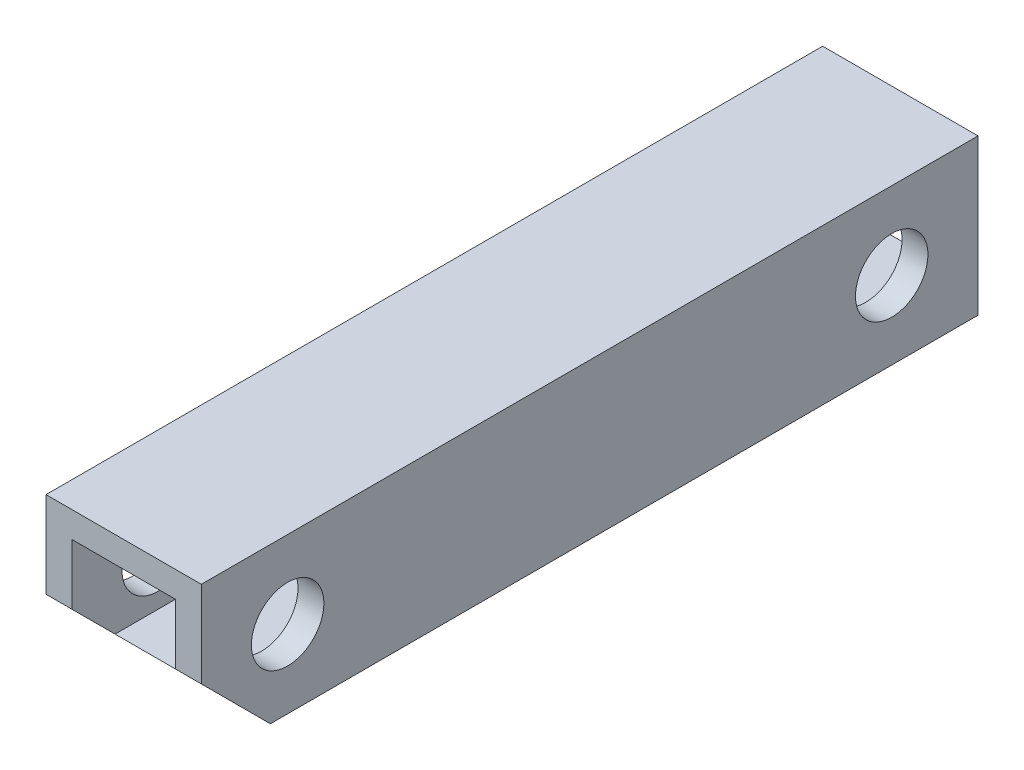
ISO-10303-21;
HEADER;
FILE_DESCRIPTION(('STEP AP214'),'2;1');
FILE_NAME('part.step','',(''),(''),'','','');
FILE_SCHEMA(('AUTOMOTIVE_DESIGN { 1 0 10303 214 1 1 1 1 }'));
ENDSEC;
DATA;
#1=APPLICATION_CONTEXT('core data for automotive mechanical design processes');
#2=APPLICATION_PROTOCOL_DEFINITION('international standard','automotive_design',2000,#1);
#3=PRODUCT_CONTEXT('',#1,'mechanical');
#4=PRODUCT('Part','Part','',(#3));
#5=PRODUCT_RELATED_PRODUCT_CATEGORY('part','',(#4));
#6=PRODUCT_DEFINITION_FORMATION('','',#4);
#7=PRODUCT_DEFINITION_CONTEXT('part definition',#1,'design');
#8=PRODUCT_DEFINITION('design','',#6,#7);
#9=PRODUCT_DEFINITION_SHAPE('','',#8);
#10=(LENGTH_UNIT() NAMED_UNIT(*) SI_UNIT(.MILLI.,.METRE.));
#11=(NAMED_UNIT(*) PLANE_ANGLE_UNIT() SI_UNIT($,.RADIAN.));
#12=(NAMED_UNIT(*) SI_UNIT($,.STERADIAN.) SOLID_ANGLE_UNIT());
#13=UNCERTAINTY_MEASURE_WITH_UNIT(LENGTH_MEASURE(1.E-05),#10,'distance_accuracy_value','');
#14=(GEOMETRIC_REPRESENTATION_CONTEXT(3) GLOBAL_UNCERTAINTY_ASSIGNED_CONTEXT((#13)) GLOBAL_UNIT_ASSIGNED_CONTEXT((#10,
#11,#12)) REPRESENTATION_CONTEXT('',''));
#15=CARTESIAN_POINT('',(0.,0.,0.));
#16=DIRECTION('',(0.,0.,1.));
#17=DIRECTION('',(1.,0.,0.));
#18=AXIS2_PLACEMENT_3D('',#15,#16,#17);
#19=CARTESIAN_POINT('',(0.,0.,45.));
#20=DIRECTION('',(0.,0.,1.));
#21=DIRECTION('',(1.,0.,0.));
#22=AXIS2_PLACEMENT_3D('',#19,#20,#21);
#23=PLANE('',#22);
#24=DIRECTION('',(1.,0.,0.));
#25=VECTOR('',#24,1.);
#26=CARTESIAN_POINT('',(-5.5,-0.500000000000002,45.));
#27=LINE('',#26,#25);
#28=CARTESIAN_POINT('',(3.,-0.500000000000001,45.));
#29=VERTEX_POINT('',#28);
#30=CARTESIAN_POINT('',(4.5,-0.5,45.));
#31=VERTEX_POINT('',#30);
#32=EDGE_CURVE('E118',#29,#31,#27,.T.);
#33=ORIENTED_EDGE('',*,*,#32,.T.);
#34=DIRECTION('',(0.,1.,0.));
#35=VECTOR('',#34,1.);
#36=CARTESIAN_POINT('',(4.5,4.5,45.));
#37=LINE('',#36,#35);
#38=CARTESIAN_POINT('',(4.5,4.5,45.));
#39=VERTEX_POINT('',#38);
#40=EDGE_CURVE('E126',#31,#39,#37,.T.);
#41=ORIENTED_EDGE('',*,*,#40,.T.);
#42=DIRECTION('',(-1.,0.,0.));
#43=VECTOR('',#42,1.);
#44=CARTESIAN_POINT('',(-4.5,4.5,45.));
#45=LINE('',#44,#43);
#46=CARTESIAN_POINT('',(-4.5,4.5,45.));
#47=VERTEX_POINT('',#46);
#48=EDGE_CURVE('E138',#39,#47,#45,.T.);
#49=ORIENTED_EDGE('',*,*,#48,.T.);
#50=DIRECTION('',(0.,-1.,0.));
#51=VECTOR('',#50,1.);
#52=CARTESIAN_POINT('',(-4.5,4.5,45.));
#53=LINE('',#52,#51);
#54=CARTESIAN_POINT('',(-4.5,-0.500000000000002,45.));
#55=VERTEX_POINT('',#54);
#56=EDGE_CURVE('E133',#47,#55,#53,.T.);
#57=ORIENTED_EDGE('',*,*,#56,.T.);
#58=CARTESIAN_POINT('',(-3.,-0.500000000000002,45.));
#59=VERTEX_POINT('',#58);
#60=EDGE_CURVE('E219',#55,#59,#27,.T.);
#61=ORIENTED_EDGE('',*,*,#60,.T.);
#62=DIRECTION('',(0.,-1.,0.));
#63=VECTOR('',#62,1.);
#64=CARTESIAN_POINT('',(-3.,3.,45.));
#65=LINE('',#64,#63);
#66=CARTESIAN_POINT('',(-3.,3.,45.));
#67=VERTEX_POINT('',#66);
#68=EDGE_CURVE('E176',#67,#59,#65,.T.);
#69=ORIENTED_EDGE('',*,*,#68,.F.);
#70=DIRECTION('',(-1.,0.,0.));
#71=VECTOR('',#70,1.);
#72=CARTESIAN_POINT('',(-3.,3.,45.));
#73=LINE('',#72,#71);
#74=CARTESIAN_POINT('',(3.,3.,45.));
#75=VERTEX_POINT('',#74);
#76=EDGE_CURVE('E173',#75,#67,#73,.T.);
#77=ORIENTED_EDGE('',*,*,#76,.F.);
#78=DIRECTION('',(0.,1.,0.));
#79=VECTOR('',#78,1.);
#80=CARTESIAN_POINT('',(3.,3.,45.));
#81=LINE('',#80,#79);
#82=EDGE_CURVE('E171',#29,#75,#81,.T.);
#83=ORIENTED_EDGE('',*,*,#82,.F.);
#84=EDGE_LOOP('',(#33,#41,#49,#57,#61,#69,#77,#83));
#85=FACE_BOUND('',#84,.T.);
#86=ADVANCED_FACE('F33',(#85),#23,.T.);
#87=CARTESIAN_POINT('',(0.,0.,0.));
#88=DIRECTION('',(0.,0.,1.));
#89=DIRECTION('',(1.,0.,0.));
#90=AXIS2_PLACEMENT_3D('',#87,#88,#89);
#91=PLANE('',#90);
#92=DIRECTION('',(0.,1.,0.));
#93=VECTOR('',#92,1.);
#94=CARTESIAN_POINT('',(4.5,4.5,0.));
#95=LINE('',#94,#93);
#96=CARTESIAN_POINT('',(4.5,-4.5,0.));
#97=VERTEX_POINT('',#96);
#98=CARTESIAN_POINT('',(4.5,4.5,0.));
#99=VERTEX_POINT('',#98);
#100=EDGE_CURVE('E197',#97,#99,#95,.T.);
#101=ORIENTED_EDGE('',*,*,#100,.F.);
#102=DIRECTION('',(1.,0.,0.));
#103=VECTOR('',#102,1.);
#104=CARTESIAN_POINT('',(-4.5,-4.5,0.));
#105=LINE('',#104,#103);
#106=CARTESIAN_POINT('',(-4.5,-4.5,0.));
#107=VERTEX_POINT('',#106);
#108=EDGE_CURVE('E130',#107,#97,#105,.T.);
#109=ORIENTED_EDGE('',*,*,#108,.F.);
#110=DIRECTION('',(0.,-1.,0.));
#111=VECTOR('',#110,1.);
#112=CARTESIAN_POINT('',(-4.5,4.5,0.));
#113=LINE('',#112,#111);
#114=CARTESIAN_POINT('',(-4.5,4.5,0.));
#115=VERTEX_POINT('',#114);
#116=EDGE_CURVE('E202',#115,#107,#113,.T.);
#117=ORIENTED_EDGE('',*,*,#116,.F.);
#118=DIRECTION('',(-1.,0.,0.));
#119=VECTOR('',#118,1.);
#120=CARTESIAN_POINT('',(-4.5,4.5,0.));
#121=LINE('',#120,#119);
#122=EDGE_CURVE('E201',#99,#115,#121,.T.);
#123=ORIENTED_EDGE('',*,*,#122,.F.);
#124=EDGE_LOOP('',(#101,#109,#117,#123));
#125=FACE_BOUND('',#124,.T.);
#126=DIRECTION('',(0.,1.,0.));
#127=VECTOR('',#126,1.);
#128=CARTESIAN_POINT('',(3.,3.,0.));
#129=LINE('',#128,#127);
#130=CARTESIAN_POINT('',(3.,-3.,0.));
#131=VERTEX_POINT('',#130);
#132=CARTESIAN_POINT('',(3.,3.,0.));
#133=VERTEX_POINT('',#132);
#134=EDGE_CURVE('E170',#131,#133,#129,.T.);
#135=ORIENTED_EDGE('',*,*,#134,.T.);
#136=DIRECTION('',(-1.,0.,0.));
#137=VECTOR('',#136,1.);
#138=CARTESIAN_POINT('',(-3.,3.,0.));
#139=LINE('',#138,#137);
#140=CARTESIAN_POINT('',(-3.,3.,0.));
#141=VERTEX_POINT('',#140);
#142=EDGE_CURVE('E181',#133,#141,#139,.T.);
#143=ORIENTED_EDGE('',*,*,#142,.T.);
#144=DIRECTION('',(0.,-1.,0.));
#145=VECTOR('',#144,1.);
#146=CARTESIAN_POINT('',(-3.,3.,0.));
#147=LINE('',#146,#145);
#148=CARTESIAN_POINT('',(-3.,-3.,0.));
#149=VERTEX_POINT('',#148);
#150=EDGE_CURVE('E184',#141,#149,#147,.T.);
#151=ORIENTED_EDGE('',*,*,#150,.T.);
#152=DIRECTION('',(1.,0.,0.));
#153=VECTOR('',#152,1.);
#154=CARTESIAN_POINT('',(-3.,-3.,0.));
#155=LINE('',#154,#153);
#156=EDGE_CURVE('E174',#149,#131,#155,.T.);
#157=ORIENTED_EDGE('',*,*,#156,.T.);
#158=EDGE_LOOP('',(#135,#143,#151,#157));
#159=FACE_BOUND('',#158,.T.);
#160=ADVANCED_FACE('F210',(#125,#159),#91,.F.);
#161=CARTESIAN_POINT('',(4.5,4.5,45.));
#162=DIRECTION('',(-1.,0.,0.));
#163=DIRECTION('',(0.,-1.,0.));
#164=AXIS2_PLACEMENT_3D('',#161,#162,#163);
#165=PLANE('',#164);
#166=CARTESIAN_POINT('',(4.5,0.,40.));
#167=DIRECTION('',(1.,0.,0.));
#168=DIRECTION('',(0.,1.,0.));
#169=AXIS2_PLACEMENT_3D('',#166,#167,#168);
#170=CIRCLE('',#169,2.1);
#171=CARTESIAN_POINT('',(4.5,2.1,40.));
#172=VERTEX_POINT('',#171);
#173=EDGE_CURVE('E150',#172,#172,#170,.T.);
#174=ORIENTED_EDGE('',*,*,#173,.F.);
#175=EDGE_LOOP('',(#174));
#176=FACE_BOUND('',#175,.T.);
#177=CARTESIAN_POINT('',(4.5,0.,5.));
#178=DIRECTION('',(1.,0.,0.));
#179=DIRECTION('',(0.,1.,0.));
#180=AXIS2_PLACEMENT_3D('',#177,#178,#179);
#181=CIRCLE('',#180,2.1);
#182=CARTESIAN_POINT('',(4.5,2.1,5.));
#183=VERTEX_POINT('',#182);
#184=EDGE_CURVE('E226',#183,#183,#181,.T.);
#185=ORIENTED_EDGE('',*,*,#184,.F.);
#186=EDGE_LOOP('',(#185));
#187=FACE_BOUND('',#186,.T.);
#188=ORIENTED_EDGE('',*,*,#40,.F.);
#189=DIRECTION('',(0.,0.707106781186547,0.707106781186548));
#190=VECTOR('',#189,1.);
#191=CARTESIAN_POINT('',(4.5,-0.5,45.));
#192=LINE('',#191,#190);
#193=CARTESIAN_POINT('',(4.5,-4.5,41.));
#194=VERTEX_POINT('',#193);
#195=EDGE_CURVE('E111',#194,#31,#192,.T.);
#196=ORIENTED_EDGE('',*,*,#195,.F.);
#197=DIRECTION('',(0.,0.,-1.));
#198=VECTOR('',#197,1.);
#199=CARTESIAN_POINT('',(4.5,-4.5,45.));
#200=LINE('',#199,#198);
#201=EDGE_CURVE('E123',#194,#97,#200,.T.);
#202=ORIENTED_EDGE('',*,*,#201,.T.);
#203=ORIENTED_EDGE('',*,*,#100,.T.);
#204=DIRECTION('',(0.,0.,-1.));
#205=VECTOR('',#204,1.);
#206=CARTESIAN_POINT('',(4.5,4.5,45.));
#207=LINE('',#206,#205);
#208=EDGE_CURVE('E41',#39,#99,#207,.T.);
#209=ORIENTED_EDGE('',*,*,#208,.F.);
#210=EDGE_LOOP('',(#188,#196,#202,#203,#209));
#211=FACE_BOUND('',#210,.T.);
#212=ADVANCED_FACE('F35',(#176,#187,#211),#165,.F.);
#213=CARTESIAN_POINT('',(-4.5,4.5,45.));
#214=DIRECTION('',(0.,-1.,0.));
#215=DIRECTION('',(0.,0.,-1.));
#216=AXIS2_PLACEMENT_3D('',#213,#214,#215);
#217=PLANE('',#216);
#218=ORIENTED_EDGE('',*,*,#122,.T.);
#219=DIRECTION('',(0.,0.,-1.));
#220=VECTOR('',#219,1.);
#221=CARTESIAN_POINT('',(-4.5,4.5,45.));
#222=LINE('',#221,#220);
#223=EDGE_CURVE('E135',#47,#115,#222,.T.);
#224=ORIENTED_EDGE('',*,*,#223,.F.);
#225=ORIENTED_EDGE('',*,*,#48,.F.);
#226=ORIENTED_EDGE('',*,*,#208,.T.);
#227=EDGE_LOOP('',(#218,#224,#225,#226));
#228=FACE_BOUND('',#227,.T.);
#229=ADVANCED_FACE('F214',(#228),#217,.F.);
#230=CARTESIAN_POINT('',(-4.5,4.5,45.));
#231=DIRECTION('',(1.,0.,0.));
#232=DIRECTION('',(0.,1.,0.));
#233=AXIS2_PLACEMENT_3D('',#230,#231,#232);
#234=PLANE('',#233);
#235=CARTESIAN_POINT('',(-4.5,0.,40.));
#236=DIRECTION('',(1.,0.,0.));
#237=DIRECTION('',(0.,1.,0.));
#238=AXIS2_PLACEMENT_3D('',#235,#236,#237);
#239=CIRCLE('',#238,2.1);
#240=CARTESIAN_POINT('',(-4.5,2.1,40.));
#241=VERTEX_POINT('',#240);
#242=EDGE_CURVE('E158',#241,#241,#239,.T.);
#243=ORIENTED_EDGE('',*,*,#242,.T.);
#244=EDGE_LOOP('',(#243));
#245=FACE_BOUND('',#244,.T.);
#246=CARTESIAN_POINT('',(-4.5,0.,5.));
#247=DIRECTION('',(1.,0.,0.));
#248=DIRECTION('',(0.,1.,0.));
#249=AXIS2_PLACEMENT_3D('',#246,#247,#248);
#250=CIRCLE('',#249,2.1);
#251=CARTESIAN_POINT('',(-4.5,2.1,5.));
#252=VERTEX_POINT('',#251);
#253=EDGE_CURVE('E154',#252,#252,#250,.T.);
#254=ORIENTED_EDGE('',*,*,#253,.T.);
#255=EDGE_LOOP('',(#254));
#256=FACE_BOUND('',#255,.T.);
#257=DIRECTION('',(0.,0.,-1.));
#258=VECTOR('',#257,1.);
#259=CARTESIAN_POINT('',(-4.5,-4.5,45.));
#260=LINE('',#259,#258);
#261=CARTESIAN_POINT('',(-4.5,-4.5,41.));
#262=VERTEX_POINT('',#261);
#263=EDGE_CURVE('E132',#262,#107,#260,.T.);
#264=ORIENTED_EDGE('',*,*,#263,.F.);
#265=DIRECTION('',(0.,0.707106781186547,0.707106781186548));
#266=VECTOR('',#265,1.);
#267=CARTESIAN_POINT('',(-4.5,2.,47.5));
#268=LINE('',#267,#266);
#269=EDGE_CURVE('E114',#262,#55,#268,.T.);
#270=ORIENTED_EDGE('',*,*,#269,.T.);
#271=ORIENTED_EDGE('',*,*,#56,.F.);
#272=ORIENTED_EDGE('',*,*,#223,.T.);
#273=ORIENTED_EDGE('',*,*,#116,.T.);
#274=EDGE_LOOP('',(#264,#270,#271,#272,#273));
#275=FACE_BOUND('',#274,.T.);
#276=ADVANCED_FACE('F206',(#245,#256,#275),#234,.F.);
#277=CARTESIAN_POINT('',(-4.5,-4.5,45.));
#278=DIRECTION('',(0.,1.,0.));
#279=DIRECTION('',(0.,0.,1.));
#280=AXIS2_PLACEMENT_3D('',#277,#278,#279);
#281=PLANE('',#280);
#282=ORIENTED_EDGE('',*,*,#201,.F.);
#283=DIRECTION('',(1.,0.,0.));
#284=VECTOR('',#283,1.);
#285=CARTESIAN_POINT('',(-5.5,-4.5,41.));
#286=LINE('',#285,#284);
#287=EDGE_CURVE('E108',#262,#194,#286,.T.);
#288=ORIENTED_EDGE('',*,*,#287,.F.);
#289=ORIENTED_EDGE('',*,*,#263,.T.);
#290=ORIENTED_EDGE('',*,*,#108,.T.);
#291=EDGE_LOOP('',(#282,#288,#289,#290));
#292=FACE_BOUND('',#291,.T.);
#293=ADVANCED_FACE('F128',(#292),#281,.F.);
#294=CARTESIAN_POINT('',(3.,3.,45.));
#295=DIRECTION('',(-1.,0.,0.));
#296=DIRECTION('',(0.,-1.,0.));
#297=AXIS2_PLACEMENT_3D('',#294,#295,#296);
#298=PLANE('',#297);
#299=DIRECTION('',(0.,-0.707106781186547,-0.707106781186548));
#300=VECTOR('',#299,1.);
#301=CARTESIAN_POINT('',(3.,1.25,46.75));
#302=LINE('',#301,#300);
#303=CARTESIAN_POINT('',(3.,-3.,42.5));
#304=VERTEX_POINT('',#303);
#305=EDGE_CURVE('E47',#29,#304,#302,.T.);
#306=ORIENTED_EDGE('',*,*,#305,.F.);
#307=ORIENTED_EDGE('',*,*,#82,.T.);
#308=DIRECTION('',(0.,0.,-1.));
#309=VECTOR('',#308,1.);
#310=CARTESIAN_POINT('',(3.,3.,45.));
#311=LINE('',#310,#309);
#312=EDGE_CURVE('E194',#75,#133,#311,.T.);
#313=ORIENTED_EDGE('',*,*,#312,.T.);
#314=ORIENTED_EDGE('',*,*,#134,.F.);
#315=DIRECTION('',(0.,0.,-1.));
#316=VECTOR('',#315,1.);
#317=CARTESIAN_POINT('',(3.,-3.,45.));
#318=LINE('',#317,#316);
#319=EDGE_CURVE('E54',#304,#131,#318,.T.);
#320=ORIENTED_EDGE('',*,*,#319,.F.);
#321=EDGE_LOOP('',(#306,#307,#313,#314,#320));
#322=FACE_BOUND('',#321,.T.);
#323=CARTESIAN_POINT('',(3.,0.,40.));
#324=DIRECTION('',(-1.,0.,0.));
#325=DIRECTION('',(0.,-1.,0.));
#326=AXIS2_PLACEMENT_3D('',#323,#324,#325);
#327=CIRCLE('',#326,2.1);
#328=CARTESIAN_POINT('',(3.,-2.1,40.));
#329=VERTEX_POINT('',#328);
#330=EDGE_CURVE('E153',#329,#329,#327,.T.);
#331=ORIENTED_EDGE('',*,*,#330,.F.);
#332=EDGE_LOOP('',(#331));
#333=FACE_BOUND('',#332,.T.);
#334=CARTESIAN_POINT('',(3.,0.,5.));
#335=DIRECTION('',(-1.,0.,0.));
#336=DIRECTION('',(0.,-1.,0.));
#337=AXIS2_PLACEMENT_3D('',#334,#335,#336);
#338=CIRCLE('',#337,2.1);
#339=CARTESIAN_POINT('',(3.,-2.1,5.));
#340=VERTEX_POINT('',#339);
#341=EDGE_CURVE('E149',#340,#340,#338,.T.);
#342=ORIENTED_EDGE('',*,*,#341,.F.);
#343=EDGE_LOOP('',(#342));
#344=FACE_BOUND('',#343,.T.);
#345=ADVANCED_FACE('F248',(#322,#333,#344),#298,.T.);
#346=CARTESIAN_POINT('',(-3.,3.,45.));
#347=DIRECTION('',(0.,-1.,0.));
#348=DIRECTION('',(0.,0.,-1.));
#349=AXIS2_PLACEMENT_3D('',#346,#347,#348);
#350=PLANE('',#349);
#351=ORIENTED_EDGE('',*,*,#142,.F.);
#352=ORIENTED_EDGE('',*,*,#312,.F.);
#353=ORIENTED_EDGE('',*,*,#76,.T.);
#354=DIRECTION('',(0.,0.,-1.));
#355=VECTOR('',#354,1.);
#356=CARTESIAN_POINT('',(-3.,3.,45.));
#357=LINE('',#356,#355);
#358=EDGE_CURVE('E192',#67,#141,#357,.T.);
#359=ORIENTED_EDGE('',*,*,#358,.T.);
#360=EDGE_LOOP('',(#351,#352,#353,#359));
#361=FACE_BOUND('',#360,.T.);
#362=ADVANCED_FACE('F281',(#361),#350,.T.);
#363=CARTESIAN_POINT('',(-3.,3.,45.));
#364=DIRECTION('',(1.,0.,0.));
#365=DIRECTION('',(0.,1.,0.));
#366=AXIS2_PLACEMENT_3D('',#363,#364,#365);
#367=PLANE('',#366);
#368=DIRECTION('',(0.,0.707106781186547,0.707106781186548));
#369=VECTOR('',#368,1.);
#370=CARTESIAN_POINT('',(-3.,1.25,46.75));
#371=LINE('',#370,#369);
#372=CARTESIAN_POINT('',(-3.,-3.,42.5));
#373=VERTEX_POINT('',#372);
#374=EDGE_CURVE('E221',#373,#59,#371,.T.);
#375=ORIENTED_EDGE('',*,*,#374,.F.);
#376=DIRECTION('',(0.,0.,-1.));
#377=VECTOR('',#376,1.);
#378=CARTESIAN_POINT('',(-3.,-3.,45.));
#379=LINE('',#378,#377);
#380=EDGE_CURVE('E190',#373,#149,#379,.T.);
#381=ORIENTED_EDGE('',*,*,#380,.T.);
#382=ORIENTED_EDGE('',*,*,#150,.F.);
#383=ORIENTED_EDGE('',*,*,#358,.F.);
#384=ORIENTED_EDGE('',*,*,#68,.T.);
#385=EDGE_LOOP('',(#375,#381,#382,#383,#384));
#386=FACE_BOUND('',#385,.T.);
#387=CARTESIAN_POINT('',(-3.,0.,40.));
#388=DIRECTION('',(1.,0.,0.));
#389=DIRECTION('',(0.,1.,0.));
#390=AXIS2_PLACEMENT_3D('',#387,#388,#389);
#391=CIRCLE('',#390,2.1);
#392=CARTESIAN_POINT('',(-3.,2.1,40.));
#393=VERTEX_POINT('',#392);
#394=EDGE_CURVE('E151',#393,#393,#391,.T.);
#395=ORIENTED_EDGE('',*,*,#394,.F.);
#396=EDGE_LOOP('',(#395));
#397=FACE_BOUND('',#396,.T.);
#398=CARTESIAN_POINT('',(-3.,0.,5.));
#399=DIRECTION('',(1.,0.,0.));
#400=DIRECTION('',(0.,1.,0.));
#401=AXIS2_PLACEMENT_3D('',#398,#399,#400);
#402=CIRCLE('',#401,2.1);
#403=CARTESIAN_POINT('',(-3.,2.1,5.));
#404=VERTEX_POINT('',#403);
#405=EDGE_CURVE('E147',#404,#404,#402,.T.);
#406=ORIENTED_EDGE('',*,*,#405,.F.);
#407=EDGE_LOOP('',(#406));
#408=FACE_BOUND('',#407,.T.);
#409=ADVANCED_FACE('F288',(#386,#397,#408),#367,.T.);
#410=CARTESIAN_POINT('',(-3.,-3.,45.));
#411=DIRECTION('',(0.,1.,0.));
#412=DIRECTION('',(0.,0.,1.));
#413=AXIS2_PLACEMENT_3D('',#410,#411,#412);
#414=PLANE('',#413);
#415=DIRECTION('',(-1.,0.,0.));
#416=VECTOR('',#415,1.);
#417=CARTESIAN_POINT('',(-3.,-3.,42.5));
#418=LINE('',#417,#416);
#419=EDGE_CURVE('E11',#304,#373,#418,.T.);
#420=ORIENTED_EDGE('',*,*,#419,.F.);
#421=ORIENTED_EDGE('',*,*,#319,.T.);
#422=ORIENTED_EDGE('',*,*,#156,.F.);
#423=ORIENTED_EDGE('',*,*,#380,.F.);
#424=EDGE_LOOP('',(#420,#421,#422,#423));
#425=FACE_BOUND('',#424,.T.);
#426=ADVANCED_FACE('F269',(#425),#414,.T.);
#427=CARTESIAN_POINT('',(-25.5,0.,5.));
#428=DIRECTION('',(1.,0.,0.));
#429=DIRECTION('',(0.,1.,0.));
#430=AXIS2_PLACEMENT_3D('',#427,#428,#429);
#431=CYLINDRICAL_SURFACE('',#430,2.1);
#432=ORIENTED_EDGE('',*,*,#405,.T.);
#433=EDGE_LOOP('',(#432));
#434=FACE_BOUND('',#433,.T.);
#435=ORIENTED_EDGE('',*,*,#253,.F.);
#436=EDGE_LOOP('',(#435));
#437=FACE_BOUND('',#436,.T.);
#438=ADVANCED_FACE('F260',(#434,#437),#431,.F.);
#439=CARTESIAN_POINT('',(-25.5,0.,40.));
#440=DIRECTION('',(1.,0.,0.));
#441=DIRECTION('',(0.,1.,0.));
#442=AXIS2_PLACEMENT_3D('',#439,#440,#441);
#443=CYLINDRICAL_SURFACE('',#442,2.1);
#444=ORIENTED_EDGE('',*,*,#394,.T.);
#445=EDGE_LOOP('',(#444));
#446=FACE_BOUND('',#445,.T.);
#447=ORIENTED_EDGE('',*,*,#242,.F.);
#448=EDGE_LOOP('',(#447));
#449=FACE_BOUND('',#448,.T.);
#450=ADVANCED_FACE('F258',(#446,#449),#443,.F.);
#451=ORIENTED_EDGE('',*,*,#341,.T.);
#452=EDGE_LOOP('',(#451));
#453=FACE_BOUND('',#452,.T.);
#454=ORIENTED_EDGE('',*,*,#184,.T.);
#455=EDGE_LOOP('',(#454));
#456=FACE_BOUND('',#455,.T.);
#457=ADVANCED_FACE('F231',(#453,#456),#431,.F.);
#458=ORIENTED_EDGE('',*,*,#330,.T.);
#459=EDGE_LOOP('',(#458));
#460=FACE_BOUND('',#459,.T.);
#461=ORIENTED_EDGE('',*,*,#173,.T.);
#462=EDGE_LOOP('',(#461));
#463=FACE_BOUND('',#462,.T.);
#464=ADVANCED_FACE('F262',(#460,#463),#443,.F.);
#465=CARTESIAN_POINT('',(-5.5,-0.500000000000002,45.));
#466=DIRECTION('',(0.,0.707106781186548,-0.707106781186547));
#467=DIRECTION('',(0.,0.707106781186547,0.707106781186548));
#468=AXIS2_PLACEMENT_3D('',#465,#466,#467);
#469=PLANE('',#468);
#470=ORIENTED_EDGE('',*,*,#287,.T.);
#471=ORIENTED_EDGE('',*,*,#195,.T.);
#472=ORIENTED_EDGE('',*,*,#32,.F.);
#473=ORIENTED_EDGE('',*,*,#305,.T.);
#474=ORIENTED_EDGE('',*,*,#419,.T.);
#475=ORIENTED_EDGE('',*,*,#374,.T.);
#476=ORIENTED_EDGE('',*,*,#60,.F.);
#477=ORIENTED_EDGE('',*,*,#269,.F.);
#478=EDGE_LOOP('',(#470,#471,#472,#473,#474,#475,#476,#477));
#479=FACE_BOUND('',#478,.T.);
#480=ADVANCED_FACE('F110',(#479),#469,.F.);
#481=CLOSED_SHELL('',(#86,#160,#212,#229,#276,#293,#345,#362,#409,#426,#438,#450,#457,#464,#480));
#482=MANIFOLD_SOLID_BREP('B2',#481);
#483=ADVANCED_BREP_SHAPE_REPRESENTATION('',(#18,#482),#14);
#484=SHAPE_DEFINITION_REPRESENTATION(#9,#483);
ENDSEC;
END-ISO-10303-21;
